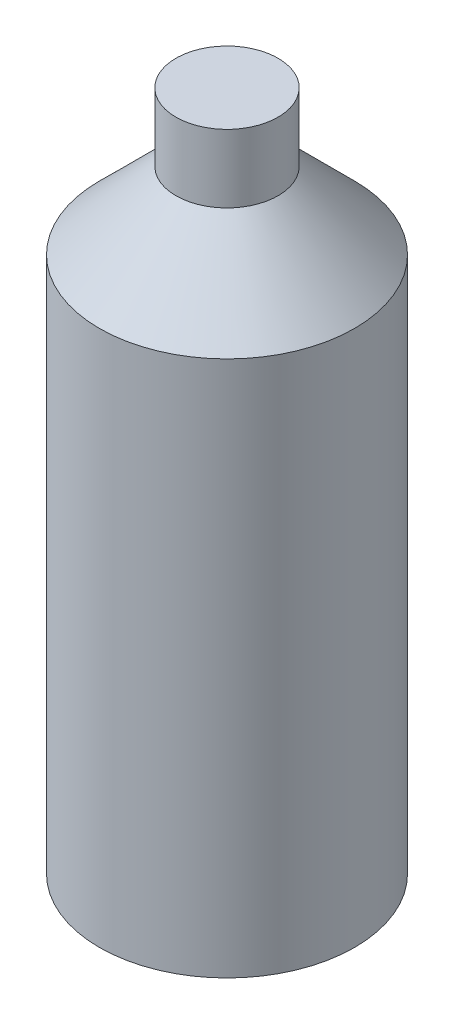
ISO-10303-21;
HEADER;
FILE_DESCRIPTION(('STEP AP214'),'2;1');
FILE_NAME('part.step','',(''),(''),'','','');
FILE_SCHEMA(('AUTOMOTIVE_DESIGN { 1 0 10303 214 1 1 1 1 }'));
ENDSEC;
DATA;
#1=APPLICATION_CONTEXT('core data for automotive mechanical design processes');
#2=APPLICATION_PROTOCOL_DEFINITION('international standard','automotive_design',2000,#1);
#3=PRODUCT_CONTEXT('',#1,'mechanical');
#4=PRODUCT('Part','Part','',(#3));
#5=PRODUCT_RELATED_PRODUCT_CATEGORY('part','',(#4));
#6=PRODUCT_DEFINITION_FORMATION('','',#4);
#7=PRODUCT_DEFINITION_CONTEXT('part definition',#1,'design');
#8=PRODUCT_DEFINITION('design','',#6,#7);
#9=PRODUCT_DEFINITION_SHAPE('','',#8);
#10=(LENGTH_UNIT() NAMED_UNIT(*) SI_UNIT(.MILLI.,.METRE.));
#11=(NAMED_UNIT(*) PLANE_ANGLE_UNIT() SI_UNIT($,.RADIAN.));
#12=(NAMED_UNIT(*) SI_UNIT($,.STERADIAN.) SOLID_ANGLE_UNIT());
#13=UNCERTAINTY_MEASURE_WITH_UNIT(LENGTH_MEASURE(1.E-05),#10,'distance_accuracy_value','');
#14=(GEOMETRIC_REPRESENTATION_CONTEXT(3) GLOBAL_UNCERTAINTY_ASSIGNED_CONTEXT((#13)) GLOBAL_UNIT_ASSIGNED_CONTEXT((#10,
#11,#12)) REPRESENTATION_CONTEXT('',''));
#15=CARTESIAN_POINT('',(0.,0.,0.));
#16=DIRECTION('',(0.,0.,1.));
#17=DIRECTION('',(1.,0.,0.));
#18=AXIS2_PLACEMENT_3D('',#15,#16,#17);
#19=CARTESIAN_POINT('',(0.,200.,0.));
#20=DIRECTION('',(0.,-1.,0.));
#21=DIRECTION('',(0.,0.,-1.));
#22=AXIS2_PLACEMENT_3D('',#19,#20,#21);
#23=CYLINDRICAL_SURFACE('',#22,37.5);
#24=CARTESIAN_POINT('',(0.,157.5,0.));
#25=DIRECTION('',(0.,1.,0.));
#26=DIRECTION('',(0.,0.,1.));
#27=AXIS2_PLACEMENT_3D('',#24,#25,#26);
#28=CIRCLE('',#27,37.5);
#29=CARTESIAN_POINT('',(0.,157.5,37.5));
#30=VERTEX_POINT('',#29);
#31=EDGE_CURVE('E11',#30,#30,#28,.F.);
#32=ORIENTED_EDGE('',*,*,#31,.T.);
#33=EDGE_LOOP('',(#32));
#34=FACE_BOUND('',#33,.T.);
#35=CARTESIAN_POINT('',(0.,0.,0.));
#36=DIRECTION('',(0.,1.,0.));
#37=DIRECTION('',(0.,0.,1.));
#38=AXIS2_PLACEMENT_3D('',#35,#36,#37);
#39=CIRCLE('',#38,37.5);
#40=CARTESIAN_POINT('',(0.,0.,37.5));
#41=VERTEX_POINT('',#40);
#42=EDGE_CURVE('E37',#41,#41,#39,.T.);
#43=ORIENTED_EDGE('',*,*,#42,.T.);
#44=EDGE_LOOP('',(#43));
#45=FACE_BOUND('',#44,.T.);
#46=ADVANCED_FACE('F30',(#34,#45),#23,.T.);
#47=CARTESIAN_POINT('',(0.,0.,0.));
#48=DIRECTION('',(0.,1.,0.));
#49=DIRECTION('',(0.,0.,1.));
#50=AXIS2_PLACEMENT_3D('',#47,#48,#49);
#51=PLANE('',#50);
#52=ORIENTED_EDGE('',*,*,#42,.F.);
#53=EDGE_LOOP('',(#52));
#54=FACE_BOUND('',#53,.T.);
#55=ADVANCED_FACE('F55',(#54),#51,.F.);
#56=CARTESIAN_POINT('',(0.,180.,0.));
#57=DIRECTION('',(0.,1.,0.));
#58=DIRECTION('',(0.,0.,1.));
#59=AXIS2_PLACEMENT_3D('',#56,#57,#58);
#60=CYLINDRICAL_SURFACE('',#59,15.);
#61=CARTESIAN_POINT('',(0.,180.,0.));
#62=DIRECTION('',(0.,1.,0.));
#63=DIRECTION('',(0.,0.,1.));
#64=AXIS2_PLACEMENT_3D('',#61,#62,#63);
#65=CIRCLE('',#64,15.);
#66=CARTESIAN_POINT('',(0.,180.,15.));
#67=VERTEX_POINT('',#66);
#68=EDGE_CURVE('E41',#67,#67,#65,.T.);
#69=ORIENTED_EDGE('',*,*,#68,.T.);
#70=EDGE_LOOP('',(#69));
#71=FACE_BOUND('',#70,.T.);
#72=CARTESIAN_POINT('',(0.,200.,0.));
#73=DIRECTION('',(0.,1.,0.));
#74=DIRECTION('',(0.,0.,1.));
#75=AXIS2_PLACEMENT_3D('',#72,#73,#74);
#76=CIRCLE('',#75,15.);
#77=CARTESIAN_POINT('',(0.,200.,15.));
#78=VERTEX_POINT('',#77);
#79=EDGE_CURVE('E45',#78,#78,#76,.T.);
#80=ORIENTED_EDGE('',*,*,#79,.F.);
#81=EDGE_LOOP('',(#80));
#82=FACE_BOUND('',#81,.T.);
#83=ADVANCED_FACE('F53',(#71,#82),#60,.T.);
#84=CARTESIAN_POINT('',(0.,200.,0.));
#85=DIRECTION('',(0.,1.,0.));
#86=DIRECTION('',(0.,0.,1.));
#87=AXIS2_PLACEMENT_3D('',#84,#85,#86);
#88=PLANE('',#87);
#89=ORIENTED_EDGE('',*,*,#79,.T.);
#90=EDGE_LOOP('',(#89));
#91=FACE_BOUND('',#90,.T.);
#92=ADVANCED_FACE('F51',(#91),#88,.T.);
#93=CARTESIAN_POINT('',(0.,180.,0.));
#94=DIRECTION('',(0.,-1.,0.));
#95=DIRECTION('',(0.,0.,-1.));
#96=AXIS2_PLACEMENT_3D('',#93,#94,#95);
#97=CONICAL_SURFACE('',#96,15.,0.785398163397447);
#98=ORIENTED_EDGE('',*,*,#31,.F.);
#99=EDGE_LOOP('',(#98));
#100=FACE_BOUND('',#99,.T.);
#101=ORIENTED_EDGE('',*,*,#68,.F.);
#102=EDGE_LOOP('',(#101));
#103=FACE_BOUND('',#102,.T.);
#104=ADVANCED_FACE('F32',(#100,#103),#97,.T.);
#105=CLOSED_SHELL('',(#46,#55,#83,#92,#104));
#106=MANIFOLD_SOLID_BREP('B2',#105);
#107=ADVANCED_BREP_SHAPE_REPRESENTATION('',(#18,#106),#14);
#108=SHAPE_DEFINITION_REPRESENTATION(#9,#107);
ENDSEC;
END-ISO-10303-21;
